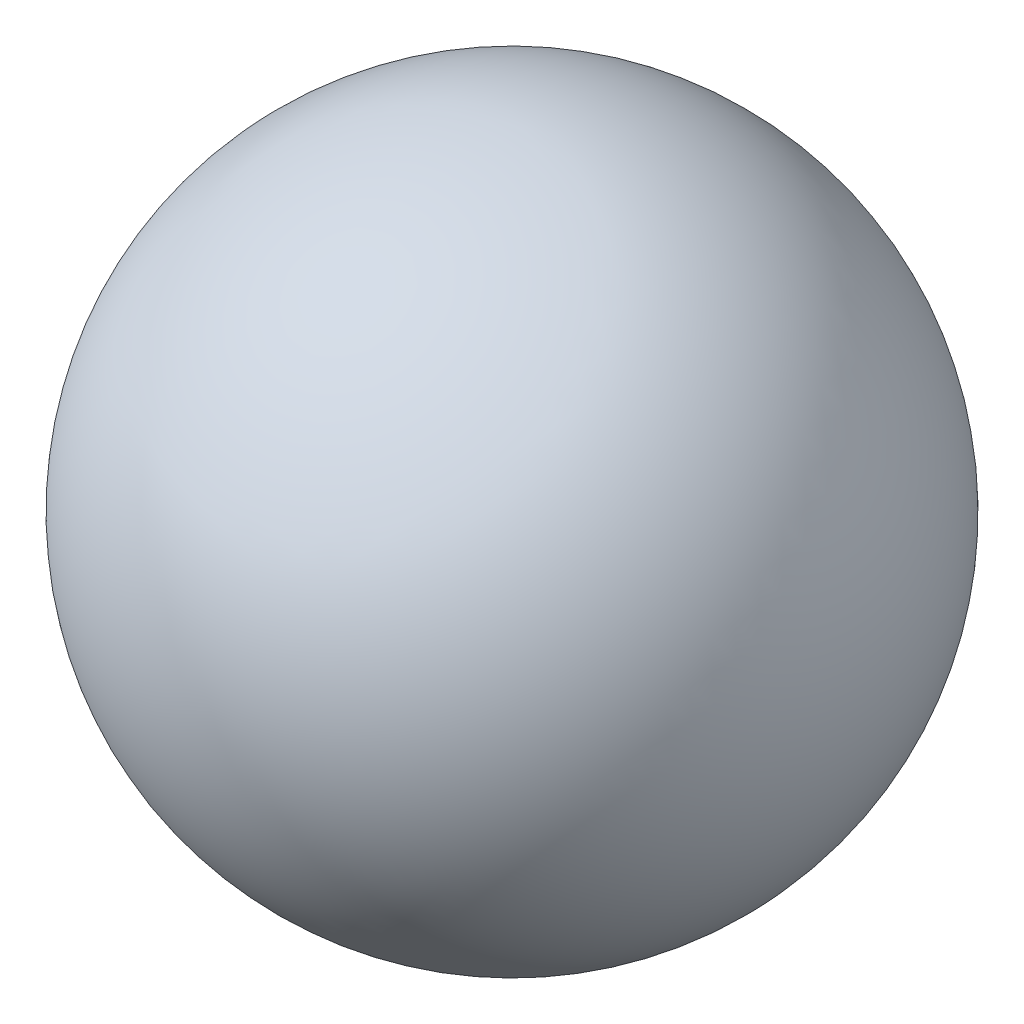
ISO-10303-21;
HEADER;
FILE_DESCRIPTION(('STEP AP214'),'2;1');
FILE_NAME('part.step','',(''),(''),'','','');
FILE_SCHEMA(('AUTOMOTIVE_DESIGN { 1 0 10303 214 1 1 1 1 }'));
ENDSEC;
DATA;
#1=APPLICATION_CONTEXT('core data for automotive mechanical design processes');
#2=APPLICATION_PROTOCOL_DEFINITION('international standard','automotive_design',2000,#1);
#3=PRODUCT_CONTEXT('',#1,'mechanical');
#4=PRODUCT('Part','Part','',(#3));
#5=PRODUCT_RELATED_PRODUCT_CATEGORY('part','',(#4));
#6=PRODUCT_DEFINITION_FORMATION('','',#4);
#7=PRODUCT_DEFINITION_CONTEXT('part definition',#1,'design');
#8=PRODUCT_DEFINITION('design','',#6,#7);
#9=PRODUCT_DEFINITION_SHAPE('','',#8);
#10=(LENGTH_UNIT() NAMED_UNIT(*) SI_UNIT(.MILLI.,.METRE.));
#11=(NAMED_UNIT(*) PLANE_ANGLE_UNIT() SI_UNIT($,.RADIAN.));
#12=(NAMED_UNIT(*) SI_UNIT($,.STERADIAN.) SOLID_ANGLE_UNIT());
#13=UNCERTAINTY_MEASURE_WITH_UNIT(LENGTH_MEASURE(1.E-05),#10,'distance_accuracy_value','');
#14=(GEOMETRIC_REPRESENTATION_CONTEXT(3) GLOBAL_UNCERTAINTY_ASSIGNED_CONTEXT((#13)) GLOBAL_UNIT_ASSIGNED_CONTEXT((#10,
#11,#12)) REPRESENTATION_CONTEXT('',''));
#15=CARTESIAN_POINT('',(0.,0.,0.));
#16=DIRECTION('',(0.,0.,1.));
#17=DIRECTION('',(1.,0.,0.));
#18=AXIS2_PLACEMENT_3D('',#15,#16,#17);
#19=CARTESIAN_POINT('',(3.85672565811929,4.59626665871316,2.));
#20=DIRECTION('',(0.76604444311897,-0.642787609686549,0.));
#21=DIRECTION('',(0.,0.,-1.));
#22=AXIS2_PLACEMENT_3D('',#19,#20,#21);
#23=SPHERICAL_SURFACE('',#22,1.04);
#24=CARTESIAN_POINT('',(3.06003943727556,5.26476577278717,2.));
#25=VERTEX_POINT('',#24);
#26=VERTEX_LOOP('',#25);
#27=FACE_BOUND('',#26,.T.);
#28=ADVANCED_FACE('F15',(#27),#23,.T.);
#29=CLOSED_SHELL('',(#28));
#30=MANIFOLD_SOLID_BREP('B1',#29);
#31=ADVANCED_BREP_SHAPE_REPRESENTATION('',(#18,#30),#14);
#32=SHAPE_DEFINITION_REPRESENTATION(#9,#31);
ENDSEC;
END-ISO-10303-21;
